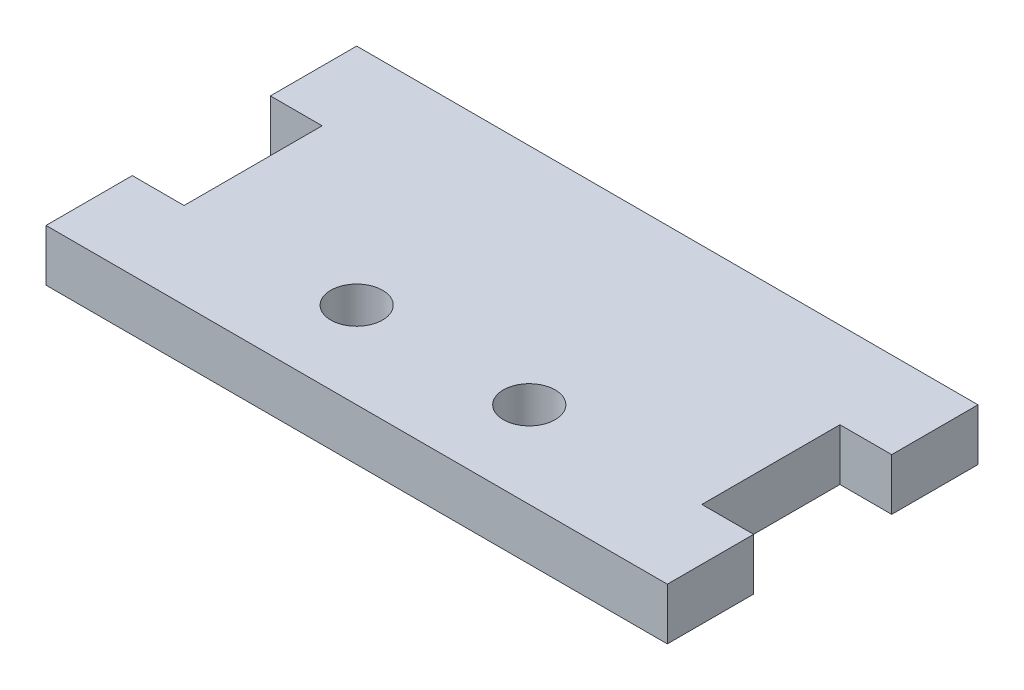
ISO-10303-21;
HEADER;
FILE_DESCRIPTION(('STEP AP214'),'2;1');
FILE_NAME('part.step','',(''),(''),'','','');
FILE_SCHEMA(('AUTOMOTIVE_DESIGN { 1 0 10303 214 1 1 1 1 }'));
ENDSEC;
DATA;
#1=APPLICATION_CONTEXT('core data for automotive mechanical design processes');
#2=APPLICATION_PROTOCOL_DEFINITION('international standard','automotive_design',2000,#1);
#3=PRODUCT_CONTEXT('',#1,'mechanical');
#4=PRODUCT('Part','Part','',(#3));
#5=PRODUCT_RELATED_PRODUCT_CATEGORY('part','',(#4));
#6=PRODUCT_DEFINITION_FORMATION('','',#4);
#7=PRODUCT_DEFINITION_CONTEXT('part definition',#1,'design');
#8=PRODUCT_DEFINITION('design','',#6,#7);
#9=PRODUCT_DEFINITION_SHAPE('','',#8);
#10=(LENGTH_UNIT() NAMED_UNIT(*) SI_UNIT(.MILLI.,.METRE.));
#11=(NAMED_UNIT(*) PLANE_ANGLE_UNIT() SI_UNIT($,.RADIAN.));
#12=(NAMED_UNIT(*) SI_UNIT($,.STERADIAN.) SOLID_ANGLE_UNIT());
#13=UNCERTAINTY_MEASURE_WITH_UNIT(LENGTH_MEASURE(1.E-05),#10,'distance_accuracy_value','');
#14=(GEOMETRIC_REPRESENTATION_CONTEXT(3) GLOBAL_UNCERTAINTY_ASSIGNED_CONTEXT((#13)) GLOBAL_UNIT_ASSIGNED_CONTEXT((#10,
#11,#12)) REPRESENTATION_CONTEXT('',''));
#15=CARTESIAN_POINT('',(0.,0.,0.));
#16=DIRECTION('',(0.,0.,1.));
#17=DIRECTION('',(1.,0.,0.));
#18=AXIS2_PLACEMENT_3D('',#15,#16,#17);
#19=CARTESIAN_POINT('',(0.,-1.5,0.));
#20=DIRECTION('',(0.,1.,0.));
#21=DIRECTION('',(0.,0.,1.));
#22=AXIS2_PLACEMENT_3D('',#19,#20,#21);
#23=PLANE('',#22);
#24=CARTESIAN_POINT('',(5.,-1.5,4.));
#25=DIRECTION('',(0.,-1.,0.));
#26=DIRECTION('',(0.,0.,-1.));
#27=AXIS2_PLACEMENT_3D('',#24,#25,#26);
#28=CIRCLE('',#27,1.5);
#29=CARTESIAN_POINT('',(5.,-1.5,2.5));
#30=VERTEX_POINT('',#29);
#31=EDGE_CURVE('E130',#30,#30,#28,.F.);
#32=ORIENTED_EDGE('',*,*,#31,.T.);
#33=EDGE_LOOP('',(#32));
#34=FACE_BOUND('',#33,.T.);
#35=CARTESIAN_POINT('',(-5.,-1.5,4.));
#36=DIRECTION('',(0.,-1.,0.));
#37=DIRECTION('',(0.,0.,-1.));
#38=AXIS2_PLACEMENT_3D('',#35,#36,#37);
#39=CIRCLE('',#38,1.5);
#40=CARTESIAN_POINT('',(-5.,-1.5,2.5));
#41=VERTEX_POINT('',#40);
#42=EDGE_CURVE('E19',#41,#41,#39,.F.);
#43=ORIENTED_EDGE('',*,*,#42,.T.);
#44=EDGE_LOOP('',(#43));
#45=FACE_BOUND('',#44,.T.);
#46=DIRECTION('',(0.,0.,-1.));
#47=VECTOR('',#46,1.);
#48=CARTESIAN_POINT('',(18.,-1.5,0.));
#49=LINE('',#48,#47);
#50=CARTESIAN_POINT('',(18.,-1.5,-4.));
#51=VERTEX_POINT('',#50);
#52=CARTESIAN_POINT('',(18.,-1.5,-9.00000000000001));
#53=VERTEX_POINT('',#52);
#54=EDGE_CURVE('E141',#51,#53,#49,.T.);
#55=ORIENTED_EDGE('',*,*,#54,.F.);
#56=DIRECTION('',(-1.,0.,0.));
#57=VECTOR('',#56,1.);
#58=CARTESIAN_POINT('',(0.,-1.5,-3.99999999999998));
#59=LINE('',#58,#57);
#60=CARTESIAN_POINT('',(15.,-1.5,-4.));
#61=VERTEX_POINT('',#60);
#62=EDGE_CURVE('E146',#51,#61,#59,.T.);
#63=ORIENTED_EDGE('',*,*,#62,.T.);
#64=DIRECTION('',(0.,0.,1.));
#65=VECTOR('',#64,1.);
#66=CARTESIAN_POINT('',(15.,-1.5,0.));
#67=LINE('',#66,#65);
#68=CARTESIAN_POINT('',(15.,-1.5,3.99999999999999));
#69=VERTEX_POINT('',#68);
#70=EDGE_CURVE('E151',#61,#69,#67,.T.);
#71=ORIENTED_EDGE('',*,*,#70,.T.);
#72=DIRECTION('',(-1.,0.,0.));
#73=VECTOR('',#72,1.);
#74=CARTESIAN_POINT('',(0.,-1.5,4.00000000000002));
#75=LINE('',#74,#73);
#76=CARTESIAN_POINT('',(18.,-1.5,3.99999999999999));
#77=VERTEX_POINT('',#76);
#78=EDGE_CURVE('E159',#77,#69,#75,.T.);
#79=ORIENTED_EDGE('',*,*,#78,.F.);
#80=DIRECTION('',(0.,0.,1.));
#81=VECTOR('',#80,1.);
#82=CARTESIAN_POINT('',(18.,-1.5,0.));
#83=LINE('',#82,#81);
#84=CARTESIAN_POINT('',(18.,-1.5,9.));
#85=VERTEX_POINT('',#84);
#86=EDGE_CURVE('E161',#77,#85,#83,.T.);
#87=ORIENTED_EDGE('',*,*,#86,.T.);
#88=DIRECTION('',(-1.,0.,0.));
#89=VECTOR('',#88,1.);
#90=CARTESIAN_POINT('',(0.,-1.5,9.));
#91=LINE('',#90,#89);
#92=CARTESIAN_POINT('',(-18.,-1.5,9.));
#93=VERTEX_POINT('',#92);
#94=EDGE_CURVE('E166',#85,#93,#91,.T.);
#95=ORIENTED_EDGE('',*,*,#94,.T.);
#96=DIRECTION('',(0.,0.,1.));
#97=VECTOR('',#96,1.);
#98=CARTESIAN_POINT('',(-18.,-1.5,0.));
#99=LINE('',#98,#97);
#100=CARTESIAN_POINT('',(-18.,-1.5,4.));
#101=VERTEX_POINT('',#100);
#102=EDGE_CURVE('E174',#101,#93,#99,.T.);
#103=ORIENTED_EDGE('',*,*,#102,.F.);
#104=DIRECTION('',(1.,0.,0.));
#105=VECTOR('',#104,1.);
#106=CARTESIAN_POINT('',(0.,-1.5,4.));
#107=LINE('',#106,#105);
#108=CARTESIAN_POINT('',(-15.,-1.5,4.));
#109=VERTEX_POINT('',#108);
#110=EDGE_CURVE('E176',#101,#109,#107,.T.);
#111=ORIENTED_EDGE('',*,*,#110,.T.);
#112=DIRECTION('',(0.,0.,1.));
#113=VECTOR('',#112,1.);
#114=CARTESIAN_POINT('',(-15.,-1.5,0.));
#115=LINE('',#114,#113);
#116=CARTESIAN_POINT('',(-15.,-1.5,-4.));
#117=VERTEX_POINT('',#116);
#118=EDGE_CURVE('E184',#117,#109,#115,.T.);
#119=ORIENTED_EDGE('',*,*,#118,.F.);
#120=DIRECTION('',(1.,0.,0.));
#121=VECTOR('',#120,1.);
#122=CARTESIAN_POINT('',(0.,-1.5,-4.00000000000001));
#123=LINE('',#122,#121);
#124=CARTESIAN_POINT('',(-18.,-1.5,-4.));
#125=VERTEX_POINT('',#124);
#126=EDGE_CURVE('E103',#125,#117,#123,.T.);
#127=ORIENTED_EDGE('',*,*,#126,.F.);
#128=DIRECTION('',(0.,0.,-1.));
#129=VECTOR('',#128,1.);
#130=CARTESIAN_POINT('',(-18.,-1.5,0.));
#131=LINE('',#130,#129);
#132=CARTESIAN_POINT('',(-18.,-1.5,-8.99999999999997));
#133=VERTEX_POINT('',#132);
#134=EDGE_CURVE('E117',#125,#133,#131,.T.);
#135=ORIENTED_EDGE('',*,*,#134,.T.);
#136=DIRECTION('',(-1.,0.,0.));
#137=VECTOR('',#136,1.);
#138=CARTESIAN_POINT('',(0.,-1.5,-8.99999999999998));
#139=LINE('',#138,#137);
#140=EDGE_CURVE('E108',#53,#133,#139,.T.);
#141=ORIENTED_EDGE('',*,*,#140,.F.);
#142=EDGE_LOOP('',(#55,#63,#71,#79,#87,#95,#103,#111,#119,#127,#135,#141));
#143=FACE_BOUND('',#142,.T.);
#144=ADVANCED_FACE('F16',(#34,#45,#143),#23,.F.);
#145=CARTESIAN_POINT('',(0.,1.5,-8.99999999999998));
#146=DIRECTION('',(0.,0.,-1.));
#147=DIRECTION('',(-1.,0.,0.));
#148=AXIS2_PLACEMENT_3D('',#145,#146,#147);
#149=PLANE('',#148);
#150=DIRECTION('',(1.,0.,0.));
#151=VECTOR('',#150,1.);
#152=CARTESIAN_POINT('',(0.,1.5,-9.00000000000001));
#153=LINE('',#152,#151);
#154=CARTESIAN_POINT('',(18.,1.5,-9.00000000000001));
#155=VERTEX_POINT('',#154);
#156=CARTESIAN_POINT('',(-18.,1.5,-8.99999999999997));
#157=VERTEX_POINT('',#156);
#158=EDGE_CURVE('E132',#155,#157,#153,.F.);
#159=ORIENTED_EDGE('',*,*,#158,.F.);
#160=DIRECTION('',(0.,1.,0.));
#161=VECTOR('',#160,1.);
#162=CARTESIAN_POINT('',(18.,1.5,-9.00000000000001));
#163=LINE('',#162,#161);
#164=EDGE_CURVE('E114',#53,#155,#163,.T.);
#165=ORIENTED_EDGE('',*,*,#164,.F.);
#166=ORIENTED_EDGE('',*,*,#140,.T.);
#167=DIRECTION('',(0.,1.,0.));
#168=VECTOR('',#167,1.);
#169=CARTESIAN_POINT('',(-18.,1.5,-9.));
#170=LINE('',#169,#168);
#171=EDGE_CURVE('E111',#133,#157,#170,.T.);
#172=ORIENTED_EDGE('',*,*,#171,.T.);
#173=EDGE_LOOP('',(#159,#165,#166,#172));
#174=FACE_BOUND('',#173,.T.);
#175=ADVANCED_FACE('F109',(#174),#149,.T.);
#176=CARTESIAN_POINT('',(-18.,1.5,0.));
#177=DIRECTION('',(1.,0.,0.));
#178=DIRECTION('',(0.,0.,-1.));
#179=AXIS2_PLACEMENT_3D('',#176,#177,#178);
#180=PLANE('',#179);
#181=DIRECTION('',(0.,1.,0.));
#182=VECTOR('',#181,1.);
#183=CARTESIAN_POINT('',(-18.,1.5,-4.));
#184=LINE('',#183,#182);
#185=CARTESIAN_POINT('',(-18.,1.5,-4.));
#186=VERTEX_POINT('',#185);
#187=EDGE_CURVE('E186',#186,#125,#184,.F.);
#188=ORIENTED_EDGE('',*,*,#187,.F.);
#189=DIRECTION('',(0.,0.,1.));
#190=VECTOR('',#189,1.);
#191=CARTESIAN_POINT('',(-18.,1.5,0.));
#192=LINE('',#191,#190);
#193=EDGE_CURVE('E123',#157,#186,#192,.T.);
#194=ORIENTED_EDGE('',*,*,#193,.F.);
#195=ORIENTED_EDGE('',*,*,#171,.F.);
#196=ORIENTED_EDGE('',*,*,#134,.F.);
#197=EDGE_LOOP('',(#188,#194,#195,#196));
#198=FACE_BOUND('',#197,.T.);
#199=ADVANCED_FACE('F121',(#198),#180,.F.);
#200=CARTESIAN_POINT('',(0.,1.5,-4.00000000000001));
#201=DIRECTION('',(0.,0.,1.));
#202=DIRECTION('',(1.,0.,0.));
#203=AXIS2_PLACEMENT_3D('',#200,#201,#202);
#204=PLANE('',#203);
#205=DIRECTION('',(1.,0.,0.));
#206=VECTOR('',#205,1.);
#207=CARTESIAN_POINT('',(0.,1.5,-4.));
#208=LINE('',#207,#206);
#209=CARTESIAN_POINT('',(-15.,1.5,-4.));
#210=VERTEX_POINT('',#209);
#211=EDGE_CURVE('E201',#186,#210,#208,.T.);
#212=ORIENTED_EDGE('',*,*,#211,.F.);
#213=ORIENTED_EDGE('',*,*,#187,.T.);
#214=ORIENTED_EDGE('',*,*,#126,.T.);
#215=DIRECTION('',(0.,1.,0.));
#216=VECTOR('',#215,1.);
#217=CARTESIAN_POINT('',(-15.,1.5,-4.));
#218=LINE('',#217,#216);
#219=EDGE_CURVE('E181',#210,#117,#218,.F.);
#220=ORIENTED_EDGE('',*,*,#219,.F.);
#221=EDGE_LOOP('',(#212,#213,#214,#220));
#222=FACE_BOUND('',#221,.T.);
#223=ADVANCED_FACE('F189',(#222),#204,.T.);
#224=CARTESIAN_POINT('',(-15.,1.5,0.));
#225=DIRECTION('',(-1.,0.,0.));
#226=DIRECTION('',(0.,0.,1.));
#227=AXIS2_PLACEMENT_3D('',#224,#225,#226);
#228=PLANE('',#227);
#229=DIRECTION('',(0.,0.,1.));
#230=VECTOR('',#229,1.);
#231=CARTESIAN_POINT('',(-15.,1.5,0.));
#232=LINE('',#231,#230);
#233=CARTESIAN_POINT('',(-15.,1.5,4.));
#234=VERTEX_POINT('',#233);
#235=EDGE_CURVE('E194',#210,#234,#232,.T.);
#236=ORIENTED_EDGE('',*,*,#235,.F.);
#237=ORIENTED_EDGE('',*,*,#219,.T.);
#238=ORIENTED_EDGE('',*,*,#118,.T.);
#239=DIRECTION('',(0.,1.,0.));
#240=VECTOR('',#239,1.);
#241=CARTESIAN_POINT('',(-15.,1.5,4.));
#242=LINE('',#241,#240);
#243=EDGE_CURVE('E179',#109,#234,#242,.T.);
#244=ORIENTED_EDGE('',*,*,#243,.T.);
#245=EDGE_LOOP('',(#236,#237,#238,#244));
#246=FACE_BOUND('',#245,.T.);
#247=ADVANCED_FACE('F192',(#246),#228,.T.);
#248=CARTESIAN_POINT('',(0.,1.5,4.));
#249=DIRECTION('',(0.,0.,1.));
#250=DIRECTION('',(1.,0.,0.));
#251=AXIS2_PLACEMENT_3D('',#248,#249,#250);
#252=PLANE('',#251);
#253=DIRECTION('',(0.,1.,0.));
#254=VECTOR('',#253,1.);
#255=CARTESIAN_POINT('',(-18.,1.5,4.));
#256=LINE('',#255,#254);
#257=CARTESIAN_POINT('',(-18.,1.5,4.));
#258=VERTEX_POINT('',#257);
#259=EDGE_CURVE('E171',#258,#101,#256,.F.);
#260=ORIENTED_EDGE('',*,*,#259,.F.);
#261=DIRECTION('',(1.,0.,0.));
#262=VECTOR('',#261,1.);
#263=CARTESIAN_POINT('',(0.,1.5,4.));
#264=LINE('',#263,#262);
#265=EDGE_CURVE('E200',#234,#258,#264,.F.);
#266=ORIENTED_EDGE('',*,*,#265,.F.);
#267=ORIENTED_EDGE('',*,*,#243,.F.);
#268=ORIENTED_EDGE('',*,*,#110,.F.);
#269=EDGE_LOOP('',(#260,#266,#267,#268));
#270=FACE_BOUND('',#269,.T.);
#271=ADVANCED_FACE('F249',(#270),#252,.F.);
#272=CARTESIAN_POINT('',(-18.,1.5,0.));
#273=DIRECTION('',(-1.,0.,0.));
#274=DIRECTION('',(0.,0.,1.));
#275=AXIS2_PLACEMENT_3D('',#272,#273,#274);
#276=PLANE('',#275);
#277=DIRECTION('',(0.,0.,1.));
#278=VECTOR('',#277,1.);
#279=CARTESIAN_POINT('',(-18.,1.5,0.));
#280=LINE('',#279,#278);
#281=CARTESIAN_POINT('',(-18.,1.5,9.));
#282=VERTEX_POINT('',#281);
#283=EDGE_CURVE('E208',#258,#282,#280,.T.);
#284=ORIENTED_EDGE('',*,*,#283,.F.);
#285=ORIENTED_EDGE('',*,*,#259,.T.);
#286=ORIENTED_EDGE('',*,*,#102,.T.);
#287=DIRECTION('',(0.,1.,0.));
#288=VECTOR('',#287,1.);
#289=CARTESIAN_POINT('',(-18.,1.5,9.));
#290=LINE('',#289,#288);
#291=EDGE_CURVE('E169',#93,#282,#290,.T.);
#292=ORIENTED_EDGE('',*,*,#291,.T.);
#293=EDGE_LOOP('',(#284,#285,#286,#292));
#294=FACE_BOUND('',#293,.T.);
#295=ADVANCED_FACE('F250',(#294),#276,.T.);
#296=CARTESIAN_POINT('',(0.,1.5,9.));
#297=DIRECTION('',(0.,0.,-1.));
#298=DIRECTION('',(-1.,0.,0.));
#299=AXIS2_PLACEMENT_3D('',#296,#297,#298);
#300=PLANE('',#299);
#301=DIRECTION('',(0.,1.,0.));
#302=VECTOR('',#301,1.);
#303=CARTESIAN_POINT('',(18.,1.5,8.99999999999999));
#304=LINE('',#303,#302);
#305=CARTESIAN_POINT('',(18.,1.5,9.));
#306=VERTEX_POINT('',#305);
#307=EDGE_CURVE('E164',#85,#306,#304,.T.);
#308=ORIENTED_EDGE('',*,*,#307,.T.);
#309=DIRECTION('',(1.,0.,0.));
#310=VECTOR('',#309,1.);
#311=CARTESIAN_POINT('',(0.,1.5,9.));
#312=LINE('',#311,#310);
#313=EDGE_CURVE('E211',#282,#306,#312,.T.);
#314=ORIENTED_EDGE('',*,*,#313,.F.);
#315=ORIENTED_EDGE('',*,*,#291,.F.);
#316=ORIENTED_EDGE('',*,*,#94,.F.);
#317=EDGE_LOOP('',(#308,#314,#315,#316));
#318=FACE_BOUND('',#317,.T.);
#319=ADVANCED_FACE('F245',(#318),#300,.F.);
#320=CARTESIAN_POINT('',(18.,1.5,0.));
#321=DIRECTION('',(-1.,0.,0.));
#322=DIRECTION('',(0.,0.,1.));
#323=AXIS2_PLACEMENT_3D('',#320,#321,#322);
#324=PLANE('',#323);
#325=DIRECTION('',(0.,1.,0.));
#326=VECTOR('',#325,1.);
#327=CARTESIAN_POINT('',(18.,1.5,3.99999999999999));
#328=LINE('',#327,#326);
#329=CARTESIAN_POINT('',(18.,1.5,3.99999999999999));
#330=VERTEX_POINT('',#329);
#331=EDGE_CURVE('E156',#330,#77,#328,.F.);
#332=ORIENTED_EDGE('',*,*,#331,.F.);
#333=DIRECTION('',(0.,0.,1.));
#334=VECTOR('',#333,1.);
#335=CARTESIAN_POINT('',(18.,1.5,0.));
#336=LINE('',#335,#334);
#337=EDGE_CURVE('E214',#306,#330,#336,.F.);
#338=ORIENTED_EDGE('',*,*,#337,.F.);
#339=ORIENTED_EDGE('',*,*,#307,.F.);
#340=ORIENTED_EDGE('',*,*,#86,.F.);
#341=EDGE_LOOP('',(#332,#338,#339,#340));
#342=FACE_BOUND('',#341,.T.);
#343=ADVANCED_FACE('F237',(#342),#324,.F.);
#344=CARTESIAN_POINT('',(0.,1.5,4.00000000000002));
#345=DIRECTION('',(0.,0.,-1.));
#346=DIRECTION('',(-1.,0.,0.));
#347=AXIS2_PLACEMENT_3D('',#344,#345,#346);
#348=PLANE('',#347);
#349=DIRECTION('',(1.,0.,0.));
#350=VECTOR('',#349,1.);
#351=CARTESIAN_POINT('',(0.,1.5,3.99999999999999));
#352=LINE('',#351,#350);
#353=CARTESIAN_POINT('',(15.,1.5,3.99999999999999));
#354=VERTEX_POINT('',#353);
#355=EDGE_CURVE('E217',#330,#354,#352,.F.);
#356=ORIENTED_EDGE('',*,*,#355,.F.);
#357=ORIENTED_EDGE('',*,*,#331,.T.);
#358=ORIENTED_EDGE('',*,*,#78,.T.);
#359=DIRECTION('',(0.,1.,0.));
#360=VECTOR('',#359,1.);
#361=CARTESIAN_POINT('',(15.,1.5,3.99999999999999));
#362=LINE('',#361,#360);
#363=EDGE_CURVE('E154',#69,#354,#362,.T.);
#364=ORIENTED_EDGE('',*,*,#363,.T.);
#365=EDGE_LOOP('',(#356,#357,#358,#364));
#366=FACE_BOUND('',#365,.T.);
#367=ADVANCED_FACE('F240',(#366),#348,.T.);
#368=CARTESIAN_POINT('',(15.,1.5,0.));
#369=DIRECTION('',(-1.,0.,0.));
#370=DIRECTION('',(0.,0.,1.));
#371=AXIS2_PLACEMENT_3D('',#368,#369,#370);
#372=PLANE('',#371);
#373=DIRECTION('',(0.,1.,0.));
#374=VECTOR('',#373,1.);
#375=CARTESIAN_POINT('',(15.,1.5,-4.));
#376=LINE('',#375,#374);
#377=CARTESIAN_POINT('',(15.,1.5,-4.));
#378=VERTEX_POINT('',#377);
#379=EDGE_CURVE('E149',#61,#378,#376,.T.);
#380=ORIENTED_EDGE('',*,*,#379,.T.);
#381=DIRECTION('',(0.,0.,1.));
#382=VECTOR('',#381,1.);
#383=CARTESIAN_POINT('',(15.,1.5,0.));
#384=LINE('',#383,#382);
#385=EDGE_CURVE('E220',#354,#378,#384,.F.);
#386=ORIENTED_EDGE('',*,*,#385,.F.);
#387=ORIENTED_EDGE('',*,*,#363,.F.);
#388=ORIENTED_EDGE('',*,*,#70,.F.);
#389=EDGE_LOOP('',(#380,#386,#387,#388));
#390=FACE_BOUND('',#389,.T.);
#391=ADVANCED_FACE('F231',(#390),#372,.F.);
#392=CARTESIAN_POINT('',(0.,1.5,-3.99999999999998));
#393=DIRECTION('',(0.,0.,-1.));
#394=DIRECTION('',(-1.,0.,0.));
#395=AXIS2_PLACEMENT_3D('',#392,#393,#394);
#396=PLANE('',#395);
#397=DIRECTION('',(0.,1.,0.));
#398=VECTOR('',#397,1.);
#399=CARTESIAN_POINT('',(18.,1.5,-4.00000000000001));
#400=LINE('',#399,#398);
#401=CARTESIAN_POINT('',(18.,1.5,-4.00000000000001));
#402=VERTEX_POINT('',#401);
#403=EDGE_CURVE('E34',#402,#51,#400,.F.);
#404=ORIENTED_EDGE('',*,*,#403,.F.);
#405=DIRECTION('',(1.,0.,0.));
#406=VECTOR('',#405,1.);
#407=CARTESIAN_POINT('',(0.,1.5,-4.));
#408=LINE('',#407,#406);
#409=EDGE_CURVE('E223',#378,#402,#408,.T.);
#410=ORIENTED_EDGE('',*,*,#409,.F.);
#411=ORIENTED_EDGE('',*,*,#379,.F.);
#412=ORIENTED_EDGE('',*,*,#62,.F.);
#413=EDGE_LOOP('',(#404,#410,#411,#412));
#414=FACE_BOUND('',#413,.T.);
#415=ADVANCED_FACE('F228',(#414),#396,.F.);
#416=CARTESIAN_POINT('',(18.,1.5,0.));
#417=DIRECTION('',(1.,0.,0.));
#418=DIRECTION('',(0.,0.,-1.));
#419=AXIS2_PLACEMENT_3D('',#416,#417,#418);
#420=PLANE('',#419);
#421=DIRECTION('',(0.,0.,1.));
#422=VECTOR('',#421,1.);
#423=CARTESIAN_POINT('',(18.,1.5,0.));
#424=LINE('',#423,#422);
#425=EDGE_CURVE('E129',#402,#155,#424,.F.);
#426=ORIENTED_EDGE('',*,*,#425,.F.);
#427=ORIENTED_EDGE('',*,*,#403,.T.);
#428=ORIENTED_EDGE('',*,*,#54,.T.);
#429=ORIENTED_EDGE('',*,*,#164,.T.);
#430=EDGE_LOOP('',(#426,#427,#428,#429));
#431=FACE_BOUND('',#430,.T.);
#432=ADVANCED_FACE('F226',(#431),#420,.T.);
#433=CARTESIAN_POINT('',(-5.,1.5,4.));
#434=DIRECTION('',(0.,-1.,0.));
#435=DIRECTION('',(0.,0.,-1.));
#436=AXIS2_PLACEMENT_3D('',#433,#434,#435);
#437=CYLINDRICAL_SURFACE('',#436,1.5);
#438=CARTESIAN_POINT('',(-5.,1.5,4.));
#439=DIRECTION('',(0.,-1.,0.));
#440=DIRECTION('',(0.,0.,-1.));
#441=AXIS2_PLACEMENT_3D('',#438,#439,#440);
#442=CIRCLE('',#441,1.5);
#443=CARTESIAN_POINT('',(-5.,1.5,2.5));
#444=VERTEX_POINT('',#443);
#445=EDGE_CURVE('E25',#444,#444,#442,.T.);
#446=ORIENTED_EDGE('',*,*,#445,.F.);
#447=EDGE_LOOP('',(#446));
#448=FACE_BOUND('',#447,.T.);
#449=ORIENTED_EDGE('',*,*,#42,.F.);
#450=EDGE_LOOP('',(#449));
#451=FACE_BOUND('',#450,.T.);
#452=ADVANCED_FACE('F267',(#448,#451),#437,.F.);
#453=CARTESIAN_POINT('',(5.,1.5,4.));
#454=DIRECTION('',(0.,-1.,0.));
#455=DIRECTION('',(0.,0.,-1.));
#456=AXIS2_PLACEMENT_3D('',#453,#454,#455);
#457=CYLINDRICAL_SURFACE('',#456,1.5);
#458=ORIENTED_EDGE('',*,*,#31,.F.);
#459=EDGE_LOOP('',(#458));
#460=FACE_BOUND('',#459,.T.);
#461=CARTESIAN_POINT('',(5.,1.5,4.));
#462=DIRECTION('',(0.,-1.,0.));
#463=DIRECTION('',(0.,0.,-1.));
#464=AXIS2_PLACEMENT_3D('',#461,#462,#463);
#465=CIRCLE('',#464,1.5);
#466=CARTESIAN_POINT('',(5.,1.5,2.5));
#467=VERTEX_POINT('',#466);
#468=EDGE_CURVE('E10',#467,#467,#465,.T.);
#469=ORIENTED_EDGE('',*,*,#468,.F.);
#470=EDGE_LOOP('',(#469));
#471=FACE_BOUND('',#470,.T.);
#472=ADVANCED_FACE('F261',(#460,#471),#457,.F.);
#473=CARTESIAN_POINT('',(0.,1.5,0.));
#474=DIRECTION('',(0.,1.,0.));
#475=DIRECTION('',(0.,0.,1.));
#476=AXIS2_PLACEMENT_3D('',#473,#474,#475);
#477=PLANE('',#476);
#478=ORIENTED_EDGE('',*,*,#468,.T.);
#479=EDGE_LOOP('',(#478));
#480=FACE_BOUND('',#479,.T.);
#481=ORIENTED_EDGE('',*,*,#445,.T.);
#482=EDGE_LOOP('',(#481));
#483=FACE_BOUND('',#482,.T.);
#484=ORIENTED_EDGE('',*,*,#409,.T.);
#485=ORIENTED_EDGE('',*,*,#425,.T.);
#486=ORIENTED_EDGE('',*,*,#158,.T.);
#487=ORIENTED_EDGE('',*,*,#193,.T.);
#488=ORIENTED_EDGE('',*,*,#211,.T.);
#489=ORIENTED_EDGE('',*,*,#235,.T.);
#490=ORIENTED_EDGE('',*,*,#265,.T.);
#491=ORIENTED_EDGE('',*,*,#283,.T.);
#492=ORIENTED_EDGE('',*,*,#313,.T.);
#493=ORIENTED_EDGE('',*,*,#337,.T.);
#494=ORIENTED_EDGE('',*,*,#355,.T.);
#495=ORIENTED_EDGE('',*,*,#385,.T.);
#496=EDGE_LOOP('',(#484,#485,#486,#487,#488,#489,#490,#491,#492,#493,#494,#495));
#497=FACE_BOUND('',#496,.T.);
#498=ADVANCED_FACE('F204',(#480,#483,#497),#477,.T.);
#499=CLOSED_SHELL('',(#144,#175,#199,#223,#247,#271,#295,#319,#343,#367,#391,#415,#432,#452,
#472,#498));
#500=MANIFOLD_SOLID_BREP('B1',#499);
#501=ADVANCED_BREP_SHAPE_REPRESENTATION('',(#18,#500),#14);
#502=SHAPE_DEFINITION_REPRESENTATION(#9,#501);
ENDSEC;
END-ISO-10303-21;
